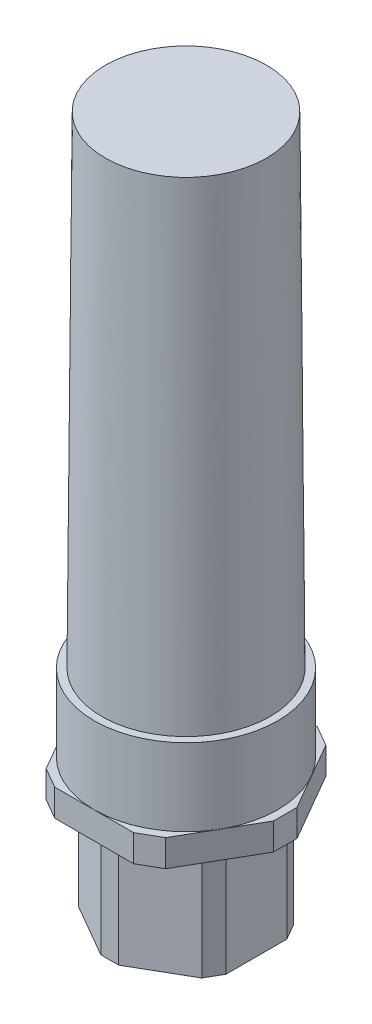
ISO-10303-21;
HEADER;
FILE_DESCRIPTION(('STEP AP214'),'2;1');
FILE_NAME('part.step','',(''),(''),'','','');
FILE_SCHEMA(('AUTOMOTIVE_DESIGN { 1 0 10303 214 1 1 1 1 }'));
ENDSEC;
DATA;
#1=APPLICATION_CONTEXT('core data for automotive mechanical design processes');
#2=APPLICATION_PROTOCOL_DEFINITION('international standard','automotive_design',2000,#1);
#3=PRODUCT_CONTEXT('',#1,'mechanical');
#4=PRODUCT('Part','Part','',(#3));
#5=PRODUCT_RELATED_PRODUCT_CATEGORY('part','',(#4));
#6=PRODUCT_DEFINITION_FORMATION('','',#4);
#7=PRODUCT_DEFINITION_CONTEXT('part definition',#1,'design');
#8=PRODUCT_DEFINITION('design','',#6,#7);
#9=PRODUCT_DEFINITION_SHAPE('','',#8);
#10=(LENGTH_UNIT() NAMED_UNIT(*) SI_UNIT(.MILLI.,.METRE.));
#11=(NAMED_UNIT(*) PLANE_ANGLE_UNIT() SI_UNIT($,.RADIAN.));
#12=(NAMED_UNIT(*) SI_UNIT($,.STERADIAN.) SOLID_ANGLE_UNIT());
#13=UNCERTAINTY_MEASURE_WITH_UNIT(LENGTH_MEASURE(1.E-05),#10,'distance_accuracy_value','');
#14=(GEOMETRIC_REPRESENTATION_CONTEXT(3) GLOBAL_UNCERTAINTY_ASSIGNED_CONTEXT((#13)) GLOBAL_UNIT_ASSIGNED_CONTEXT((#10,
#11,#12)) REPRESENTATION_CONTEXT('',''));
#15=CARTESIAN_POINT('',(0.,0.,0.));
#16=DIRECTION('',(0.,0.,1.));
#17=DIRECTION('',(1.,0.,0.));
#18=AXIS2_PLACEMENT_3D('',#15,#16,#17);
#19=CARTESIAN_POINT('',(0.,49.2252,0.));
#20=DIRECTION('',(0.,1.,0.));
#21=DIRECTION('',(0.,0.,1.));
#22=AXIS2_PLACEMENT_3D('',#19,#20,#21);
#23=PLANE('',#22);
#24=CARTESIAN_POINT('',(0.,49.2252,0.));
#25=DIRECTION('',(0.,1.,0.));
#26=DIRECTION('',(0.,0.,1.));
#27=AXIS2_PLACEMENT_3D('',#24,#25,#26);
#28=CIRCLE('',#27,21.0058);
#29=CARTESIAN_POINT('',(0.,49.2252,21.0058));
#30=VERTEX_POINT('',#29);
#31=EDGE_CURVE('E205',#30,#30,#28,.T.);
#32=ORIENTED_EDGE('',*,*,#31,.T.);
#33=EDGE_LOOP('',(#32));
#34=FACE_BOUND('',#33,.T.);
#35=CARTESIAN_POINT('',(0.,49.2252,0.));
#36=DIRECTION('',(0.,1.,0.));
#37=DIRECTION('',(0.,0.,1.));
#38=AXIS2_PLACEMENT_3D('',#35,#36,#37);
#39=CIRCLE('',#38,19.2913);
#40=CARTESIAN_POINT('',(19.2913,49.2252,0.));
#41=VERTEX_POINT('',#40);
#42=EDGE_CURVE('E202',#41,#41,#39,.T.);
#43=ORIENTED_EDGE('',*,*,#42,.F.);
#44=EDGE_LOOP('',(#43));
#45=FACE_BOUND('',#44,.T.);
#46=ADVANCED_FACE('F57',(#34,#45),#23,.T.);
#47=CARTESIAN_POINT('',(0.,0.,0.));
#48=DIRECTION('',(0.,1.,0.));
#49=DIRECTION('',(0.,0.,1.));
#50=AXIS2_PLACEMENT_3D('',#47,#48,#49);
#51=PLANE('',#50);
#52=DIRECTION('',(0.,0.,1.));
#53=VECTOR('',#52,1.);
#54=CARTESIAN_POINT('',(16.1417,0.,0.));
#55=LINE('',#54,#53);
#56=CARTESIAN_POINT('',(16.1417,0.,-6.96675547946546));
#57=VERTEX_POINT('',#56);
#58=CARTESIAN_POINT('',(16.1417,0.,6.96675547946546));
#59=VERTEX_POINT('',#58);
#60=EDGE_CURVE('E146',#57,#59,#55,.T.);
#61=ORIENTED_EDGE('',*,*,#60,.T.);
#62=DIRECTION('',(-0.5,0.,0.866025403784439));
#63=VECTOR('',#62,1.);
#64=CARTESIAN_POINT('',(15.1229686135858,0.,8.73125));
#65=LINE('',#64,#63);
#66=CARTESIAN_POINT('',(14.1042372271715,0.,10.4957445205345));
#67=VERTEX_POINT('',#66);
#68=EDGE_CURVE('E148',#59,#67,#65,.T.);
#69=ORIENTED_EDGE('',*,*,#68,.T.);
#70=DIRECTION('',(-0.866025403784439,0.,0.5));
#71=VECTOR('',#70,1.);
#72=CARTESIAN_POINT('',(8.07085,0.,13.9791222602673));
#73=LINE('',#72,#71);
#74=CARTESIAN_POINT('',(2.03746277282847,0.,17.4625));
#75=VERTEX_POINT('',#74);
#76=EDGE_CURVE('E326',#67,#75,#73,.T.);
#77=ORIENTED_EDGE('',*,*,#76,.T.);
#78=DIRECTION('',(-1.,0.,0.));
#79=VECTOR('',#78,1.);
#80=CARTESIAN_POINT('',(0.,0.,17.4625));
#81=LINE('',#80,#79);
#82=CARTESIAN_POINT('',(-2.03746277282847,0.,17.4625));
#83=VERTEX_POINT('',#82);
#84=EDGE_CURVE('E329',#75,#83,#81,.T.);
#85=ORIENTED_EDGE('',*,*,#84,.T.);
#86=DIRECTION('',(-0.866025403784439,0.,-0.5));
#87=VECTOR('',#86,1.);
#88=CARTESIAN_POINT('',(-8.07084999999999,0.,13.9791222602673));
#89=LINE('',#88,#87);
#90=CARTESIAN_POINT('',(-14.1042372271715,0.,10.4957445205345));
#91=VERTEX_POINT('',#90);
#92=EDGE_CURVE('E332',#83,#91,#89,.T.);
#93=ORIENTED_EDGE('',*,*,#92,.T.);
#94=DIRECTION('',(-0.5,0.,-0.866025403784439));
#95=VECTOR('',#94,1.);
#96=CARTESIAN_POINT('',(-15.1229686135858,0.,8.73125));
#97=LINE('',#96,#95);
#98=CARTESIAN_POINT('',(-16.1417,0.,6.96675547946546));
#99=VERTEX_POINT('',#98);
#100=EDGE_CURVE('E335',#91,#99,#97,.T.);
#101=ORIENTED_EDGE('',*,*,#100,.T.);
#102=DIRECTION('',(0.,0.,-1.));
#103=VECTOR('',#102,1.);
#104=CARTESIAN_POINT('',(-16.1417,0.,0.));
#105=LINE('',#104,#103);
#106=CARTESIAN_POINT('',(-16.1417,0.,-6.96675547946546));
#107=VERTEX_POINT('',#106);
#108=EDGE_CURVE('E338',#99,#107,#105,.T.);
#109=ORIENTED_EDGE('',*,*,#108,.T.);
#110=DIRECTION('',(0.499999999999999,0.,-0.866025403784439));
#111=VECTOR('',#110,1.);
#112=CARTESIAN_POINT('',(-15.1229686135858,0.,-8.73124999999999));
#113=LINE('',#112,#111);
#114=CARTESIAN_POINT('',(-14.1042372271715,0.,-10.4957445205345));
#115=VERTEX_POINT('',#114);
#116=EDGE_CURVE('E341',#107,#115,#113,.T.);
#117=ORIENTED_EDGE('',*,*,#116,.T.);
#118=DIRECTION('',(0.866025403784438,0.,-0.5));
#119=VECTOR('',#118,1.);
#120=CARTESIAN_POINT('',(-8.07085,0.,-13.9791222602673));
#121=LINE('',#120,#119);
#122=CARTESIAN_POINT('',(-2.03746277282848,0.,-17.4625));
#123=VERTEX_POINT('',#122);
#124=EDGE_CURVE('E142',#115,#123,#121,.T.);
#125=ORIENTED_EDGE('',*,*,#124,.T.);
#126=DIRECTION('',(1.,0.,0.));
#127=VECTOR('',#126,1.);
#128=CARTESIAN_POINT('',(0.,0.,-17.4625));
#129=LINE('',#128,#127);
#130=CARTESIAN_POINT('',(2.03746277282846,0.,-17.4625));
#131=VERTEX_POINT('',#130);
#132=EDGE_CURVE('E140',#123,#131,#129,.T.);
#133=ORIENTED_EDGE('',*,*,#132,.T.);
#134=DIRECTION('',(0.866025403784439,0.,0.5));
#135=VECTOR('',#134,1.);
#136=CARTESIAN_POINT('',(8.07084999999999,0.,-13.9791222602673));
#137=LINE('',#136,#135);
#138=CARTESIAN_POINT('',(14.1042372271715,0.,-10.4957445205345));
#139=VERTEX_POINT('',#138);
#140=EDGE_CURVE('E120',#131,#139,#137,.T.);
#141=ORIENTED_EDGE('',*,*,#140,.T.);
#142=DIRECTION('',(0.499999999999999,0.,0.866025403784439));
#143=VECTOR('',#142,1.);
#144=CARTESIAN_POINT('',(15.1229686135858,0.,-8.73124999999999));
#145=LINE('',#144,#143);
#146=EDGE_CURVE('E130',#139,#57,#145,.T.);
#147=ORIENTED_EDGE('',*,*,#146,.T.);
#148=EDGE_LOOP('',(#61,#69,#77,#85,#93,#101,#109,#117,#125,#133,#141,#147));
#149=FACE_BOUND('',#148,.T.);
#150=ADVANCED_FACE('F137',(#149),#51,.F.);
#151=CARTESIAN_POINT('',(15.1229686135858,72.9602096353664,8.73125));
#152=DIRECTION('',(0.866025403784438,0.,0.5));
#153=DIRECTION('',(0.5,0.,-0.866025403784439));
#154=AXIS2_PLACEMENT_3D('',#151,#152,#153);
#155=PLANE('',#154);
#156=DIRECTION('',(0.,-1.,0.));
#157=VECTOR('',#156,1.);
#158=CARTESIAN_POINT('',(16.1417,72.9602096353664,6.96675547946546));
#159=LINE('',#158,#157);
#160=CARTESIAN_POINT('',(16.1417,25.4,6.96675547946546));
#161=VERTEX_POINT('',#160);
#162=EDGE_CURVE('E69',#161,#59,#159,.T.);
#163=ORIENTED_EDGE('',*,*,#162,.F.);
#164=DIRECTION('',(-0.5,0.,0.866025403784439));
#165=VECTOR('',#164,1.);
#166=CARTESIAN_POINT('',(15.1229686135858,25.4,8.73125));
#167=LINE('',#166,#165);
#168=CARTESIAN_POINT('',(14.1042372271715,25.4,10.4957445205345));
#169=VERTEX_POINT('',#168);
#170=EDGE_CURVE('E135',#161,#169,#167,.T.);
#171=ORIENTED_EDGE('',*,*,#170,.T.);
#172=DIRECTION('',(0.,-1.,0.));
#173=VECTOR('',#172,1.);
#174=CARTESIAN_POINT('',(14.1042372271715,72.9602096353664,10.4957445205345));
#175=LINE('',#174,#173);
#176=EDGE_CURVE('E152',#169,#67,#175,.T.);
#177=ORIENTED_EDGE('',*,*,#176,.T.);
#178=ORIENTED_EDGE('',*,*,#68,.F.);
#179=EDGE_LOOP('',(#163,#171,#177,#178));
#180=FACE_BOUND('',#179,.T.);
#181=ADVANCED_FACE('F59',(#180),#155,.T.);
#182=CARTESIAN_POINT('',(8.07085,72.9602096353664,13.9791222602673));
#183=DIRECTION('',(0.5,0.,0.866025403784438));
#184=DIRECTION('',(0.866025403784439,0.,-0.5));
#185=AXIS2_PLACEMENT_3D('',#182,#183,#184);
#186=PLANE('',#185);
#187=ORIENTED_EDGE('',*,*,#176,.F.);
#188=DIRECTION('',(-0.866025403784439,0.,0.5));
#189=VECTOR('',#188,1.);
#190=CARTESIAN_POINT('',(8.07085,25.4,13.9791222602673));
#191=LINE('',#190,#189);
#192=CARTESIAN_POINT('',(2.03746277282847,25.4,17.4625));
#193=VERTEX_POINT('',#192);
#194=EDGE_CURVE('E186',#169,#193,#191,.T.);
#195=ORIENTED_EDGE('',*,*,#194,.T.);
#196=DIRECTION('',(0.,-1.,0.));
#197=VECTOR('',#196,1.);
#198=CARTESIAN_POINT('',(2.03746277282847,72.9602096353664,17.4625));
#199=LINE('',#198,#197);
#200=EDGE_CURVE('E185',#193,#75,#199,.T.);
#201=ORIENTED_EDGE('',*,*,#200,.T.);
#202=ORIENTED_EDGE('',*,*,#76,.F.);
#203=EDGE_LOOP('',(#187,#195,#201,#202));
#204=FACE_BOUND('',#203,.T.);
#205=ADVANCED_FACE('F375',(#204),#186,.T.);
#206=CARTESIAN_POINT('',(0.,72.9602096353664,17.4625));
#207=DIRECTION('',(0.,0.,1.));
#208=DIRECTION('',(1.,0.,0.));
#209=AXIS2_PLACEMENT_3D('',#206,#207,#208);
#210=PLANE('',#209);
#211=ORIENTED_EDGE('',*,*,#200,.F.);
#212=DIRECTION('',(-1.,0.,0.));
#213=VECTOR('',#212,1.);
#214=CARTESIAN_POINT('',(0.,25.4,17.4625));
#215=LINE('',#214,#213);
#216=CARTESIAN_POINT('',(-2.03746277282847,25.4,17.4625));
#217=VERTEX_POINT('',#216);
#218=EDGE_CURVE('E182',#193,#217,#215,.T.);
#219=ORIENTED_EDGE('',*,*,#218,.T.);
#220=DIRECTION('',(0.,-1.,0.));
#221=VECTOR('',#220,1.);
#222=CARTESIAN_POINT('',(-2.03746277282847,72.9602096353664,17.4625));
#223=LINE('',#222,#221);
#224=EDGE_CURVE('E181',#217,#83,#223,.T.);
#225=ORIENTED_EDGE('',*,*,#224,.T.);
#226=ORIENTED_EDGE('',*,*,#84,.F.);
#227=EDGE_LOOP('',(#211,#219,#225,#226));
#228=FACE_BOUND('',#227,.T.);
#229=ADVANCED_FACE('F413',(#228),#210,.T.);
#230=CARTESIAN_POINT('',(-8.07084999999999,72.9602096353664,13.9791222602673));
#231=DIRECTION('',(-0.5,0.,0.866025403784439));
#232=DIRECTION('',(0.866025403784439,0.,0.5));
#233=AXIS2_PLACEMENT_3D('',#230,#231,#232);
#234=PLANE('',#233);
#235=ORIENTED_EDGE('',*,*,#224,.F.);
#236=DIRECTION('',(-0.866025403784439,0.,-0.5));
#237=VECTOR('',#236,1.);
#238=CARTESIAN_POINT('',(-8.07084999999999,25.4,13.9791222602673));
#239=LINE('',#238,#237);
#240=CARTESIAN_POINT('',(-14.1042372271715,25.4,10.4957445205345));
#241=VERTEX_POINT('',#240);
#242=EDGE_CURVE('E178',#217,#241,#239,.T.);
#243=ORIENTED_EDGE('',*,*,#242,.T.);
#244=DIRECTION('',(0.,-1.,0.));
#245=VECTOR('',#244,1.);
#246=CARTESIAN_POINT('',(-14.1042372271715,72.9602096353664,10.4957445205345));
#247=LINE('',#246,#245);
#248=EDGE_CURVE('E177',#241,#91,#247,.T.);
#249=ORIENTED_EDGE('',*,*,#248,.T.);
#250=ORIENTED_EDGE('',*,*,#92,.F.);
#251=EDGE_LOOP('',(#235,#243,#249,#250));
#252=FACE_BOUND('',#251,.T.);
#253=ADVANCED_FACE('F410',(#252),#234,.T.);
#254=CARTESIAN_POINT('',(-15.1229686135858,72.9602096353664,8.73125));
#255=DIRECTION('',(-0.866025403784439,0.,0.5));
#256=DIRECTION('',(0.5,0.,0.866025403784439));
#257=AXIS2_PLACEMENT_3D('',#254,#255,#256);
#258=PLANE('',#257);
#259=ORIENTED_EDGE('',*,*,#248,.F.);
#260=DIRECTION('',(-0.5,0.,-0.866025403784439));
#261=VECTOR('',#260,1.);
#262=CARTESIAN_POINT('',(-15.1229686135858,25.4,8.73125));
#263=LINE('',#262,#261);
#264=CARTESIAN_POINT('',(-16.1417,25.4,6.96675547946546));
#265=VERTEX_POINT('',#264);
#266=EDGE_CURVE('E174',#241,#265,#263,.T.);
#267=ORIENTED_EDGE('',*,*,#266,.T.);
#268=DIRECTION('',(0.,-1.,0.));
#269=VECTOR('',#268,1.);
#270=CARTESIAN_POINT('',(-16.1417,72.9602096353664,6.96675547946546));
#271=LINE('',#270,#269);
#272=EDGE_CURVE('E173',#265,#99,#271,.T.);
#273=ORIENTED_EDGE('',*,*,#272,.T.);
#274=ORIENTED_EDGE('',*,*,#100,.F.);
#275=EDGE_LOOP('',(#259,#267,#273,#274));
#276=FACE_BOUND('',#275,.T.);
#277=ADVANCED_FACE('F406',(#276),#258,.T.);
#278=CARTESIAN_POINT('',(-16.1417,72.9602096353664,0.));
#279=DIRECTION('',(-1.,0.,0.));
#280=DIRECTION('',(0.,0.,1.));
#281=AXIS2_PLACEMENT_3D('',#278,#279,#280);
#282=PLANE('',#281);
#283=ORIENTED_EDGE('',*,*,#272,.F.);
#284=DIRECTION('',(0.,0.,-1.));
#285=VECTOR('',#284,1.);
#286=CARTESIAN_POINT('',(-16.1417,25.4,0.));
#287=LINE('',#286,#285);
#288=CARTESIAN_POINT('',(-16.1417,25.4,-6.96675547946546));
#289=VERTEX_POINT('',#288);
#290=EDGE_CURVE('E170',#265,#289,#287,.T.);
#291=ORIENTED_EDGE('',*,*,#290,.T.);
#292=DIRECTION('',(0.,-1.,0.));
#293=VECTOR('',#292,1.);
#294=CARTESIAN_POINT('',(-16.1417,72.9602096353664,-6.96675547946546));
#295=LINE('',#294,#293);
#296=EDGE_CURVE('E169',#289,#107,#295,.T.);
#297=ORIENTED_EDGE('',*,*,#296,.T.);
#298=ORIENTED_EDGE('',*,*,#108,.F.);
#299=EDGE_LOOP('',(#283,#291,#297,#298));
#300=FACE_BOUND('',#299,.T.);
#301=ADVANCED_FACE('F402',(#300),#282,.T.);
#302=CARTESIAN_POINT('',(-15.1229686135858,72.9602096353664,-8.73124999999999));
#303=DIRECTION('',(-0.866025403784439,0.,-0.499999999999999));
#304=DIRECTION('',(-0.499999999999999,0.,0.866025403784439));
#305=AXIS2_PLACEMENT_3D('',#302,#303,#304);
#306=PLANE('',#305);
#307=ORIENTED_EDGE('',*,*,#296,.F.);
#308=DIRECTION('',(0.499999999999999,0.,-0.866025403784439));
#309=VECTOR('',#308,1.);
#310=CARTESIAN_POINT('',(-15.1229686135858,25.4,-8.73124999999999));
#311=LINE('',#310,#309);
#312=CARTESIAN_POINT('',(-14.1042372271715,25.4,-10.4957445205345));
#313=VERTEX_POINT('',#312);
#314=EDGE_CURVE('E166',#289,#313,#311,.T.);
#315=ORIENTED_EDGE('',*,*,#314,.T.);
#316=DIRECTION('',(0.,-1.,0.));
#317=VECTOR('',#316,1.);
#318=CARTESIAN_POINT('',(-14.1042372271715,72.9602096353664,-10.4957445205345));
#319=LINE('',#318,#317);
#320=EDGE_CURVE('E165',#313,#115,#319,.T.);
#321=ORIENTED_EDGE('',*,*,#320,.T.);
#322=ORIENTED_EDGE('',*,*,#116,.F.);
#323=EDGE_LOOP('',(#307,#315,#321,#322));
#324=FACE_BOUND('',#323,.T.);
#325=ADVANCED_FACE('F399',(#324),#306,.T.);
#326=CARTESIAN_POINT('',(-8.07085,72.9602096353664,-13.9791222602673));
#327=DIRECTION('',(-0.5,0.,-0.866025403784438));
#328=DIRECTION('',(-0.866025403784438,0.,0.5));
#329=AXIS2_PLACEMENT_3D('',#326,#327,#328);
#330=PLANE('',#329);
#331=ORIENTED_EDGE('',*,*,#320,.F.);
#332=DIRECTION('',(0.866025403784438,0.,-0.5));
#333=VECTOR('',#332,1.);
#334=CARTESIAN_POINT('',(-8.07085,25.4,-13.9791222602673));
#335=LINE('',#334,#333);
#336=CARTESIAN_POINT('',(-2.03746277282848,25.4,-17.4625));
#337=VERTEX_POINT('',#336);
#338=EDGE_CURVE('E162',#313,#337,#335,.T.);
#339=ORIENTED_EDGE('',*,*,#338,.T.);
#340=DIRECTION('',(0.,-1.,0.));
#341=VECTOR('',#340,1.);
#342=CARTESIAN_POINT('',(-2.03746277282848,72.9602096353664,-17.4625));
#343=LINE('',#342,#341);
#344=EDGE_CURVE('E161',#337,#123,#343,.T.);
#345=ORIENTED_EDGE('',*,*,#344,.T.);
#346=ORIENTED_EDGE('',*,*,#124,.F.);
#347=EDGE_LOOP('',(#331,#339,#345,#346));
#348=FACE_BOUND('',#347,.T.);
#349=ADVANCED_FACE('F347',(#348),#330,.T.);
#350=CARTESIAN_POINT('',(0.,72.9602096353664,-17.4625));
#351=DIRECTION('',(0.,0.,-1.));
#352=DIRECTION('',(-1.,0.,0.));
#353=AXIS2_PLACEMENT_3D('',#350,#351,#352);
#354=PLANE('',#353);
#355=ORIENTED_EDGE('',*,*,#344,.F.);
#356=DIRECTION('',(1.,0.,0.));
#357=VECTOR('',#356,1.);
#358=CARTESIAN_POINT('',(0.,25.4,-17.4625));
#359=LINE('',#358,#357);
#360=CARTESIAN_POINT('',(2.03746277282846,25.4,-17.4625));
#361=VERTEX_POINT('',#360);
#362=EDGE_CURVE('E158',#337,#361,#359,.T.);
#363=ORIENTED_EDGE('',*,*,#362,.T.);
#364=DIRECTION('',(0.,-1.,0.));
#365=VECTOR('',#364,1.);
#366=CARTESIAN_POINT('',(2.03746277282846,72.9602096353664,-17.4625));
#367=LINE('',#366,#365);
#368=EDGE_CURVE('E157',#361,#131,#367,.T.);
#369=ORIENTED_EDGE('',*,*,#368,.T.);
#370=ORIENTED_EDGE('',*,*,#132,.F.);
#371=EDGE_LOOP('',(#355,#363,#369,#370));
#372=FACE_BOUND('',#371,.T.);
#373=ADVANCED_FACE('F353',(#372),#354,.T.);
#374=CARTESIAN_POINT('',(8.07084999999999,72.9602096353664,-13.9791222602673));
#375=DIRECTION('',(0.499999999999999,0.,-0.866025403784439));
#376=DIRECTION('',(-0.866025403784439,0.,-0.499999999999999));
#377=AXIS2_PLACEMENT_3D('',#374,#375,#376);
#378=PLANE('',#377);
#379=ORIENTED_EDGE('',*,*,#368,.F.);
#380=DIRECTION('',(0.866025403784439,0.,0.499999999999999));
#381=VECTOR('',#380,1.);
#382=CARTESIAN_POINT('',(8.07084999999999,25.4,-13.9791222602673));
#383=LINE('',#382,#381);
#384=CARTESIAN_POINT('',(14.1042372271715,25.4,-10.4957445205345));
#385=VERTEX_POINT('',#384);
#386=EDGE_CURVE('E124',#361,#385,#383,.T.);
#387=ORIENTED_EDGE('',*,*,#386,.T.);
#388=DIRECTION('',(0.,-1.,0.));
#389=VECTOR('',#388,1.);
#390=CARTESIAN_POINT('',(14.1042372271715,72.9602096353664,-10.4957445205345));
#391=LINE('',#390,#389);
#392=EDGE_CURVE('E115',#385,#139,#391,.T.);
#393=ORIENTED_EDGE('',*,*,#392,.T.);
#394=ORIENTED_EDGE('',*,*,#140,.F.);
#395=EDGE_LOOP('',(#379,#387,#393,#394));
#396=FACE_BOUND('',#395,.T.);
#397=ADVANCED_FACE('F118',(#396),#378,.T.);
#398=CARTESIAN_POINT('',(15.1229686135858,72.9602096353664,-8.73124999999999));
#399=DIRECTION('',(0.866025403784439,0.,-0.499999999999999));
#400=DIRECTION('',(-0.499999999999999,0.,-0.866025403784439));
#401=AXIS2_PLACEMENT_3D('',#398,#399,#400);
#402=PLANE('',#401);
#403=ORIENTED_EDGE('',*,*,#392,.F.);
#404=DIRECTION('',(0.499999999999999,0.,0.866025403784439));
#405=VECTOR('',#404,1.);
#406=CARTESIAN_POINT('',(15.1229686135858,25.4,-8.73124999999999));
#407=LINE('',#406,#405);
#408=CARTESIAN_POINT('',(16.1417,25.4,-6.96675547946546));
#409=VERTEX_POINT('',#408);
#410=EDGE_CURVE('E127',#385,#409,#407,.T.);
#411=ORIENTED_EDGE('',*,*,#410,.T.);
#412=DIRECTION('',(0.,-1.,0.));
#413=VECTOR('',#412,1.);
#414=CARTESIAN_POINT('',(16.1417,72.9602096353664,-6.96675547946546));
#415=LINE('',#414,#413);
#416=EDGE_CURVE('E133',#409,#57,#415,.T.);
#417=ORIENTED_EDGE('',*,*,#416,.T.);
#418=ORIENTED_EDGE('',*,*,#146,.F.);
#419=EDGE_LOOP('',(#403,#411,#417,#418));
#420=FACE_BOUND('',#419,.T.);
#421=ADVANCED_FACE('F131',(#420),#402,.T.);
#422=CARTESIAN_POINT('',(16.1417,72.9602096353664,0.));
#423=DIRECTION('',(1.,0.,0.));
#424=DIRECTION('',(0.,0.,-1.));
#425=AXIS2_PLACEMENT_3D('',#422,#423,#424);
#426=PLANE('',#425);
#427=ORIENTED_EDGE('',*,*,#416,.F.);
#428=DIRECTION('',(0.,0.,1.));
#429=VECTOR('',#428,1.);
#430=CARTESIAN_POINT('',(16.1417,25.4,0.));
#431=LINE('',#430,#429);
#432=EDGE_CURVE('E153',#409,#161,#431,.T.);
#433=ORIENTED_EDGE('',*,*,#432,.T.);
#434=ORIENTED_EDGE('',*,*,#162,.T.);
#435=ORIENTED_EDGE('',*,*,#60,.F.);
#436=EDGE_LOOP('',(#427,#433,#434,#435));
#437=FACE_BOUND('',#436,.T.);
#438=ADVANCED_FACE('F414',(#437),#426,.T.);
#439=CARTESIAN_POINT('',(0.,25.4,0.));
#440=DIRECTION('',(0.,-1.,0.));
#441=DIRECTION('',(0.,0.,-1.));
#442=AXIS2_PLACEMENT_3D('',#439,#440,#441);
#443=PLANE('',#442);
#444=DIRECTION('',(-0.5,0.,-0.866025403784439));
#445=VECTOR('',#444,1.);
#446=CARTESIAN_POINT('',(22.733,25.4,-2.68768899153671));
#447=LINE('',#446,#445);
#448=CARTESIAN_POINT('',(22.733,25.4,-2.68768899153671));
#449=VERTEX_POINT('',#448);
#450=CARTESIAN_POINT('',(13.6941069441426,25.4,-18.3435110084633));
#451=VERTEX_POINT('',#450);
#452=EDGE_CURVE('E263',#449,#451,#447,.T.);
#453=ORIENTED_EDGE('',*,*,#452,.F.);
#454=DIRECTION('',(0.,0.,-1.));
#455=VECTOR('',#454,1.);
#456=CARTESIAN_POINT('',(22.733,25.4,-2.68768899153671));
#457=LINE('',#456,#455);
#458=CARTESIAN_POINT('',(22.733,25.4,2.68768899153671));
#459=VERTEX_POINT('',#458);
#460=EDGE_CURVE('E218',#459,#449,#457,.T.);
#461=ORIENTED_EDGE('',*,*,#460,.F.);
#462=DIRECTION('',(0.5,0.,-0.866025403784439));
#463=VECTOR('',#462,1.);
#464=CARTESIAN_POINT('',(13.6941069441426,25.4,18.3435110084633));
#465=LINE('',#464,#463);
#466=CARTESIAN_POINT('',(13.6941069441426,25.4,18.3435110084633));
#467=VERTEX_POINT('',#466);
#468=EDGE_CURVE('E223',#467,#459,#465,.T.);
#469=ORIENTED_EDGE('',*,*,#468,.F.);
#470=DIRECTION('',(0.866025403784438,0.,-0.500000000000001));
#471=VECTOR('',#470,1.);
#472=CARTESIAN_POINT('',(13.6941069441426,25.4,18.3435110084633));
#473=LINE('',#472,#471);
#474=CARTESIAN_POINT('',(9.03889305585743,25.4,21.0312));
#475=VERTEX_POINT('',#474);
#476=EDGE_CURVE('E227',#475,#467,#473,.T.);
#477=ORIENTED_EDGE('',*,*,#476,.F.);
#478=DIRECTION('',(1.,0.,0.));
#479=VECTOR('',#478,1.);
#480=CARTESIAN_POINT('',(-9.03889305585743,25.4,21.0312));
#481=LINE('',#480,#479);
#482=CARTESIAN_POINT('',(-9.03889305585743,25.4,21.0312));
#483=VERTEX_POINT('',#482);
#484=EDGE_CURVE('E231',#483,#475,#481,.T.);
#485=ORIENTED_EDGE('',*,*,#484,.F.);
#486=DIRECTION('',(0.866025403784439,0.,0.5));
#487=VECTOR('',#486,1.);
#488=CARTESIAN_POINT('',(-9.03889305585743,25.4,21.0312));
#489=LINE('',#488,#487);
#490=CARTESIAN_POINT('',(-13.6941069441426,25.4,18.3435110084633));
#491=VERTEX_POINT('',#490);
#492=EDGE_CURVE('E235',#491,#483,#489,.T.);
#493=ORIENTED_EDGE('',*,*,#492,.F.);
#494=DIRECTION('',(0.5,0.,0.866025403784439));
#495=VECTOR('',#494,1.);
#496=CARTESIAN_POINT('',(-22.733,25.4,2.68768899153672));
#497=LINE('',#496,#495);
#498=CARTESIAN_POINT('',(-22.733,25.4,2.68768899153672));
#499=VERTEX_POINT('',#498);
#500=EDGE_CURVE('E239',#499,#491,#497,.T.);
#501=ORIENTED_EDGE('',*,*,#500,.F.);
#502=DIRECTION('',(0.,0.,1.));
#503=VECTOR('',#502,1.);
#504=CARTESIAN_POINT('',(-22.733,25.4,2.68768899153672));
#505=LINE('',#504,#503);
#506=CARTESIAN_POINT('',(-22.733,25.4,-2.68768899153671));
#507=VERTEX_POINT('',#506);
#508=EDGE_CURVE('E243',#507,#499,#505,.T.);
#509=ORIENTED_EDGE('',*,*,#508,.F.);
#510=DIRECTION('',(-0.5,0.,0.866025403784439));
#511=VECTOR('',#510,1.);
#512=CARTESIAN_POINT('',(-13.6941069441426,25.4,-18.3435110084633));
#513=LINE('',#512,#511);
#514=CARTESIAN_POINT('',(-13.6941069441426,25.4,-18.3435110084633));
#515=VERTEX_POINT('',#514);
#516=EDGE_CURVE('E247',#515,#507,#513,.T.);
#517=ORIENTED_EDGE('',*,*,#516,.F.);
#518=DIRECTION('',(-0.866025403784438,0.,0.500000000000001));
#519=VECTOR('',#518,1.);
#520=CARTESIAN_POINT('',(-13.6941069441426,25.4,-18.3435110084633));
#521=LINE('',#520,#519);
#522=CARTESIAN_POINT('',(-9.03889305585744,25.4,-21.0312));
#523=VERTEX_POINT('',#522);
#524=EDGE_CURVE('E251',#523,#515,#521,.T.);
#525=ORIENTED_EDGE('',*,*,#524,.F.);
#526=DIRECTION('',(-1.,0.,0.));
#527=VECTOR('',#526,1.);
#528=CARTESIAN_POINT('',(9.03889305585741,25.4,-21.0312));
#529=LINE('',#528,#527);
#530=CARTESIAN_POINT('',(9.03889305585741,25.4,-21.0312));
#531=VERTEX_POINT('',#530);
#532=EDGE_CURVE('E255',#531,#523,#529,.T.);
#533=ORIENTED_EDGE('',*,*,#532,.F.);
#534=DIRECTION('',(-0.866025403784439,0.,-0.5));
#535=VECTOR('',#534,1.);
#536=CARTESIAN_POINT('',(9.03889305585741,25.4,-21.0312));
#537=LINE('',#536,#535);
#538=EDGE_CURVE('E259',#451,#531,#537,.T.);
#539=ORIENTED_EDGE('',*,*,#538,.F.);
#540=EDGE_LOOP('',(#453,#461,#469,#477,#485,#493,#501,#509,#517,#525,#533,#539));
#541=FACE_BOUND('',#540,.T.);
#542=ORIENTED_EDGE('',*,*,#432,.F.);
#543=ORIENTED_EDGE('',*,*,#410,.F.);
#544=ORIENTED_EDGE('',*,*,#386,.F.);
#545=ORIENTED_EDGE('',*,*,#362,.F.);
#546=ORIENTED_EDGE('',*,*,#338,.F.);
#547=ORIENTED_EDGE('',*,*,#314,.F.);
#548=ORIENTED_EDGE('',*,*,#290,.F.);
#549=ORIENTED_EDGE('',*,*,#266,.F.);
#550=ORIENTED_EDGE('',*,*,#242,.F.);
#551=ORIENTED_EDGE('',*,*,#218,.F.);
#552=ORIENTED_EDGE('',*,*,#194,.F.);
#553=ORIENTED_EDGE('',*,*,#170,.F.);
#554=EDGE_LOOP('',(#542,#543,#544,#545,#546,#547,#548,#549,#550,#551,#552,#553));
#555=FACE_BOUND('',#554,.T.);
#556=ADVANCED_FACE('F368',(#541,#555),#443,.T.);
#557=CARTESIAN_POINT('',(22.733,93.5109007432348,-2.68768899153671));
#558=DIRECTION('',(-0.866025403784439,0.,0.5));
#559=DIRECTION('',(0.5,0.,0.866025403784439));
#560=AXIS2_PLACEMENT_3D('',#557,#558,#559);
#561=PLANE('',#560);
#562=DIRECTION('',(-0.5,0.,-0.866025403784439));
#563=VECTOR('',#562,1.);
#564=CARTESIAN_POINT('',(22.733,31.5722,-2.68768899153671));
#565=LINE('',#564,#563);
#566=CARTESIAN_POINT('',(22.733,31.5722,-2.68768899153671));
#567=VERTEX_POINT('',#566);
#568=CARTESIAN_POINT('',(13.6941069441426,31.5722,-18.3435110084633));
#569=VERTEX_POINT('',#568);
#570=EDGE_CURVE('E295',#567,#569,#565,.T.);
#571=ORIENTED_EDGE('',*,*,#570,.F.);
#572=DIRECTION('',(0.,-1.,0.));
#573=VECTOR('',#572,1.);
#574=CARTESIAN_POINT('',(22.733,93.5109007432348,-2.68768899153671));
#575=LINE('',#574,#573);
#576=EDGE_CURVE('E209',#567,#449,#575,.T.);
#577=ORIENTED_EDGE('',*,*,#576,.T.);
#578=ORIENTED_EDGE('',*,*,#452,.T.);
#579=DIRECTION('',(0.,-1.,0.));
#580=VECTOR('',#579,1.);
#581=CARTESIAN_POINT('',(13.6941069441426,93.5109007432348,-18.3435110084633));
#582=LINE('',#581,#580);
#583=EDGE_CURVE('E262',#569,#451,#582,.T.);
#584=ORIENTED_EDGE('',*,*,#583,.F.);
#585=EDGE_LOOP('',(#571,#577,#578,#584));
#586=FACE_BOUND('',#585,.T.);
#587=ADVANCED_FACE('F421',(#586),#561,.F.);
#588=CARTESIAN_POINT('',(9.03889305585741,93.5109007432348,-21.0312));
#589=DIRECTION('',(-0.5,0.,0.866025403784439));
#590=DIRECTION('',(0.866025403784439,0.,0.5));
#591=AXIS2_PLACEMENT_3D('',#588,#589,#590);
#592=PLANE('',#591);
#593=DIRECTION('',(-0.866025403784439,0.,-0.5));
#594=VECTOR('',#593,1.);
#595=CARTESIAN_POINT('',(9.03889305585741,31.5722,-21.0312));
#596=LINE('',#595,#594);
#597=CARTESIAN_POINT('',(9.03889305585741,31.5722,-21.0312));
#598=VERTEX_POINT('',#597);
#599=EDGE_CURVE('E292',#569,#598,#596,.T.);
#600=ORIENTED_EDGE('',*,*,#599,.F.);
#601=ORIENTED_EDGE('',*,*,#583,.T.);
#602=ORIENTED_EDGE('',*,*,#538,.T.);
#603=DIRECTION('',(0.,-1.,0.));
#604=VECTOR('',#603,1.);
#605=CARTESIAN_POINT('',(9.03889305585741,93.5109007432348,-21.0312));
#606=LINE('',#605,#604);
#607=EDGE_CURVE('E258',#598,#531,#606,.T.);
#608=ORIENTED_EDGE('',*,*,#607,.F.);
#609=EDGE_LOOP('',(#600,#601,#602,#608));
#610=FACE_BOUND('',#609,.T.);
#611=ADVANCED_FACE('F478',(#610),#592,.F.);
#612=CARTESIAN_POINT('',(9.03889305585741,93.5109007432348,-21.0312));
#613=DIRECTION('',(0.,0.,1.));
#614=DIRECTION('',(1.,0.,0.));
#615=AXIS2_PLACEMENT_3D('',#612,#613,#614);
#616=PLANE('',#615);
#617=DIRECTION('',(-1.,0.,0.));
#618=VECTOR('',#617,1.);
#619=CARTESIAN_POINT('',(9.03889305585741,31.5722,-21.0312));
#620=LINE('',#619,#618);
#621=CARTESIAN_POINT('',(-9.03889305585744,31.5722,-21.0312));
#622=VERTEX_POINT('',#621);
#623=EDGE_CURVE('E289',#598,#622,#620,.T.);
#624=ORIENTED_EDGE('',*,*,#623,.F.);
#625=ORIENTED_EDGE('',*,*,#607,.T.);
#626=ORIENTED_EDGE('',*,*,#532,.T.);
#627=DIRECTION('',(0.,-1.,0.));
#628=VECTOR('',#627,1.);
#629=CARTESIAN_POINT('',(-9.03889305585744,93.5109007432348,-21.0312));
#630=LINE('',#629,#628);
#631=EDGE_CURVE('E254',#622,#523,#630,.T.);
#632=ORIENTED_EDGE('',*,*,#631,.F.);
#633=EDGE_LOOP('',(#624,#625,#626,#632));
#634=FACE_BOUND('',#633,.T.);
#635=ADVANCED_FACE('F474',(#634),#616,.F.);
#636=CARTESIAN_POINT('',(-13.6941069441426,93.5109007432348,-18.3435110084633));
#637=DIRECTION('',(0.500000000000001,0.,0.866025403784438));
#638=DIRECTION('',(0.866025403784438,0.,-0.500000000000001));
#639=AXIS2_PLACEMENT_3D('',#636,#637,#638);
#640=PLANE('',#639);
#641=DIRECTION('',(-0.866025403784438,0.,0.500000000000001));
#642=VECTOR('',#641,1.);
#643=CARTESIAN_POINT('',(-13.6941069441426,31.5722,-18.3435110084633));
#644=LINE('',#643,#642);
#645=CARTESIAN_POINT('',(-13.6941069441426,31.5722,-18.3435110084633));
#646=VERTEX_POINT('',#645);
#647=EDGE_CURVE('E286',#622,#646,#644,.T.);
#648=ORIENTED_EDGE('',*,*,#647,.F.);
#649=ORIENTED_EDGE('',*,*,#631,.T.);
#650=ORIENTED_EDGE('',*,*,#524,.T.);
#651=DIRECTION('',(0.,-1.,0.));
#652=VECTOR('',#651,1.);
#653=CARTESIAN_POINT('',(-13.6941069441426,93.5109007432348,-18.3435110084633));
#654=LINE('',#653,#652);
#655=EDGE_CURVE('E250',#646,#515,#654,.T.);
#656=ORIENTED_EDGE('',*,*,#655,.F.);
#657=EDGE_LOOP('',(#648,#649,#650,#656));
#658=FACE_BOUND('',#657,.T.);
#659=ADVANCED_FACE('F470',(#658),#640,.F.);
#660=CARTESIAN_POINT('',(-13.6941069441426,93.5109007432348,-18.3435110084633));
#661=DIRECTION('',(0.866025403784439,0.,0.5));
#662=DIRECTION('',(0.5,0.,-0.866025403784439));
#663=AXIS2_PLACEMENT_3D('',#660,#661,#662);
#664=PLANE('',#663);
#665=DIRECTION('',(-0.5,0.,0.866025403784439));
#666=VECTOR('',#665,1.);
#667=CARTESIAN_POINT('',(-13.6941069441426,31.5722,-18.3435110084633));
#668=LINE('',#667,#666);
#669=CARTESIAN_POINT('',(-22.733,31.5722,-2.68768899153671));
#670=VERTEX_POINT('',#669);
#671=EDGE_CURVE('E283',#646,#670,#668,.T.);
#672=ORIENTED_EDGE('',*,*,#671,.F.);
#673=ORIENTED_EDGE('',*,*,#655,.T.);
#674=ORIENTED_EDGE('',*,*,#516,.T.);
#675=DIRECTION('',(0.,-1.,0.));
#676=VECTOR('',#675,1.);
#677=CARTESIAN_POINT('',(-22.733,93.5109007432348,-2.68768899153671));
#678=LINE('',#677,#676);
#679=EDGE_CURVE('E246',#670,#507,#678,.T.);
#680=ORIENTED_EDGE('',*,*,#679,.F.);
#681=EDGE_LOOP('',(#672,#673,#674,#680));
#682=FACE_BOUND('',#681,.T.);
#683=ADVANCED_FACE('F466',(#682),#664,.F.);
#684=CARTESIAN_POINT('',(-22.733,93.5109007432348,2.68768899153672));
#685=DIRECTION('',(1.,0.,0.));
#686=DIRECTION('',(0.,0.,-1.));
#687=AXIS2_PLACEMENT_3D('',#684,#685,#686);
#688=PLANE('',#687);
#689=DIRECTION('',(0.,0.,1.));
#690=VECTOR('',#689,1.);
#691=CARTESIAN_POINT('',(-22.733,31.5722,2.68768899153672));
#692=LINE('',#691,#690);
#693=CARTESIAN_POINT('',(-22.733,31.5722,2.68768899153672));
#694=VERTEX_POINT('',#693);
#695=EDGE_CURVE('E280',#670,#694,#692,.T.);
#696=ORIENTED_EDGE('',*,*,#695,.F.);
#697=ORIENTED_EDGE('',*,*,#679,.T.);
#698=ORIENTED_EDGE('',*,*,#508,.T.);
#699=DIRECTION('',(0.,-1.,0.));
#700=VECTOR('',#699,1.);
#701=CARTESIAN_POINT('',(-22.733,93.5109007432348,2.68768899153672));
#702=LINE('',#701,#700);
#703=EDGE_CURVE('E242',#694,#499,#702,.T.);
#704=ORIENTED_EDGE('',*,*,#703,.F.);
#705=EDGE_LOOP('',(#696,#697,#698,#704));
#706=FACE_BOUND('',#705,.T.);
#707=ADVANCED_FACE('F462',(#706),#688,.F.);
#708=CARTESIAN_POINT('',(-22.733,93.5109007432348,2.68768899153672));
#709=DIRECTION('',(0.866025403784439,0.,-0.5));
#710=DIRECTION('',(-0.5,0.,-0.866025403784439));
#711=AXIS2_PLACEMENT_3D('',#708,#709,#710);
#712=PLANE('',#711);
#713=DIRECTION('',(0.5,0.,0.866025403784439));
#714=VECTOR('',#713,1.);
#715=CARTESIAN_POINT('',(-22.733,31.5722,2.68768899153672));
#716=LINE('',#715,#714);
#717=CARTESIAN_POINT('',(-13.6941069441426,31.5722,18.3435110084633));
#718=VERTEX_POINT('',#717);
#719=EDGE_CURVE('E277',#694,#718,#716,.T.);
#720=ORIENTED_EDGE('',*,*,#719,.F.);
#721=ORIENTED_EDGE('',*,*,#703,.T.);
#722=ORIENTED_EDGE('',*,*,#500,.T.);
#723=DIRECTION('',(0.,-1.,0.));
#724=VECTOR('',#723,1.);
#725=CARTESIAN_POINT('',(-13.6941069441426,93.5109007432348,18.3435110084633));
#726=LINE('',#725,#724);
#727=EDGE_CURVE('E238',#718,#491,#726,.T.);
#728=ORIENTED_EDGE('',*,*,#727,.F.);
#729=EDGE_LOOP('',(#720,#721,#722,#728));
#730=FACE_BOUND('',#729,.T.);
#731=ADVANCED_FACE('F458',(#730),#712,.F.);
#732=CARTESIAN_POINT('',(-9.03889305585743,93.5109007432348,21.0312));
#733=DIRECTION('',(0.5,0.,-0.866025403784439));
#734=DIRECTION('',(-0.866025403784439,0.,-0.5));
#735=AXIS2_PLACEMENT_3D('',#732,#733,#734);
#736=PLANE('',#735);
#737=DIRECTION('',(0.866025403784439,0.,0.5));
#738=VECTOR('',#737,1.);
#739=CARTESIAN_POINT('',(-9.03889305585743,31.5722,21.0312));
#740=LINE('',#739,#738);
#741=CARTESIAN_POINT('',(-9.03889305585743,31.5722,21.0312));
#742=VERTEX_POINT('',#741);
#743=EDGE_CURVE('E274',#718,#742,#740,.T.);
#744=ORIENTED_EDGE('',*,*,#743,.F.);
#745=ORIENTED_EDGE('',*,*,#727,.T.);
#746=ORIENTED_EDGE('',*,*,#492,.T.);
#747=DIRECTION('',(0.,-1.,0.));
#748=VECTOR('',#747,1.);
#749=CARTESIAN_POINT('',(-9.03889305585743,93.5109007432348,21.0312));
#750=LINE('',#749,#748);
#751=EDGE_CURVE('E234',#742,#483,#750,.T.);
#752=ORIENTED_EDGE('',*,*,#751,.F.);
#753=EDGE_LOOP('',(#744,#745,#746,#752));
#754=FACE_BOUND('',#753,.T.);
#755=ADVANCED_FACE('F454',(#754),#736,.F.);
#756=CARTESIAN_POINT('',(-9.03889305585743,93.5109007432348,21.0312));
#757=DIRECTION('',(0.,0.,-1.));
#758=DIRECTION('',(-1.,0.,0.));
#759=AXIS2_PLACEMENT_3D('',#756,#757,#758);
#760=PLANE('',#759);
#761=DIRECTION('',(1.,0.,0.));
#762=VECTOR('',#761,1.);
#763=CARTESIAN_POINT('',(-9.03889305585743,31.5722,21.0312));
#764=LINE('',#763,#762);
#765=CARTESIAN_POINT('',(9.03889305585743,31.5722,21.0312));
#766=VERTEX_POINT('',#765);
#767=EDGE_CURVE('E271',#742,#766,#764,.T.);
#768=ORIENTED_EDGE('',*,*,#767,.F.);
#769=ORIENTED_EDGE('',*,*,#751,.T.);
#770=ORIENTED_EDGE('',*,*,#484,.T.);
#771=DIRECTION('',(0.,-1.,0.));
#772=VECTOR('',#771,1.);
#773=CARTESIAN_POINT('',(9.03889305585743,93.5109007432348,21.0312));
#774=LINE('',#773,#772);
#775=EDGE_CURVE('E230',#766,#475,#774,.T.);
#776=ORIENTED_EDGE('',*,*,#775,.F.);
#777=EDGE_LOOP('',(#768,#769,#770,#776));
#778=FACE_BOUND('',#777,.T.);
#779=ADVANCED_FACE('F450',(#778),#760,.F.);
#780=CARTESIAN_POINT('',(13.6941069441426,93.5109007432348,18.3435110084633));
#781=DIRECTION('',(-0.500000000000001,0.,-0.866025403784438));
#782=DIRECTION('',(-0.866025403784438,0.,0.500000000000001));
#783=AXIS2_PLACEMENT_3D('',#780,#781,#782);
#784=PLANE('',#783);
#785=DIRECTION('',(0.866025403784438,0.,-0.500000000000001));
#786=VECTOR('',#785,1.);
#787=CARTESIAN_POINT('',(13.6941069441426,31.5722,18.3435110084633));
#788=LINE('',#787,#786);
#789=CARTESIAN_POINT('',(13.6941069441426,31.5722,18.3435110084633));
#790=VERTEX_POINT('',#789);
#791=EDGE_CURVE('E268',#766,#790,#788,.T.);
#792=ORIENTED_EDGE('',*,*,#791,.F.);
#793=ORIENTED_EDGE('',*,*,#775,.T.);
#794=ORIENTED_EDGE('',*,*,#476,.T.);
#795=DIRECTION('',(0.,-1.,0.));
#796=VECTOR('',#795,1.);
#797=CARTESIAN_POINT('',(13.6941069441426,93.5109007432348,18.3435110084633));
#798=LINE('',#797,#796);
#799=EDGE_CURVE('E226',#790,#467,#798,.T.);
#800=ORIENTED_EDGE('',*,*,#799,.F.);
#801=EDGE_LOOP('',(#792,#793,#794,#800));
#802=FACE_BOUND('',#801,.T.);
#803=ADVANCED_FACE('F446',(#802),#784,.F.);
#804=CARTESIAN_POINT('',(13.6941069441426,93.5109007432348,18.3435110084633));
#805=DIRECTION('',(-0.866025403784439,0.,-0.5));
#806=DIRECTION('',(-0.5,0.,0.866025403784439));
#807=AXIS2_PLACEMENT_3D('',#804,#805,#806);
#808=PLANE('',#807);
#809=DIRECTION('',(0.5,0.,-0.866025403784439));
#810=VECTOR('',#809,1.);
#811=CARTESIAN_POINT('',(13.6941069441426,31.5722,18.3435110084633));
#812=LINE('',#811,#810);
#813=CARTESIAN_POINT('',(22.733,31.5722,2.68768899153671));
#814=VERTEX_POINT('',#813);
#815=EDGE_CURVE('E149',#790,#814,#812,.T.);
#816=ORIENTED_EDGE('',*,*,#815,.F.);
#817=ORIENTED_EDGE('',*,*,#799,.T.);
#818=ORIENTED_EDGE('',*,*,#468,.T.);
#819=DIRECTION('',(0.,-1.,0.));
#820=VECTOR('',#819,1.);
#821=CARTESIAN_POINT('',(22.733,93.5109007432348,2.68768899153671));
#822=LINE('',#821,#820);
#823=EDGE_CURVE('E222',#814,#459,#822,.T.);
#824=ORIENTED_EDGE('',*,*,#823,.F.);
#825=EDGE_LOOP('',(#816,#817,#818,#824));
#826=FACE_BOUND('',#825,.T.);
#827=ADVANCED_FACE('F442',(#826),#808,.F.);
#828=CARTESIAN_POINT('',(22.733,93.5109007432348,-2.68768899153671));
#829=DIRECTION('',(-1.,0.,0.));
#830=DIRECTION('',(0.,0.,1.));
#831=AXIS2_PLACEMENT_3D('',#828,#829,#830);
#832=PLANE('',#831);
#833=DIRECTION('',(0.,0.,-1.));
#834=VECTOR('',#833,1.);
#835=CARTESIAN_POINT('',(22.733,31.5722,-2.68768899153671));
#836=LINE('',#835,#834);
#837=EDGE_CURVE('E221',#814,#567,#836,.T.);
#838=ORIENTED_EDGE('',*,*,#837,.F.);
#839=ORIENTED_EDGE('',*,*,#823,.T.);
#840=ORIENTED_EDGE('',*,*,#460,.T.);
#841=ORIENTED_EDGE('',*,*,#576,.F.);
#842=EDGE_LOOP('',(#838,#839,#840,#841));
#843=FACE_BOUND('',#842,.T.);
#844=ADVANCED_FACE('F438',(#843),#832,.F.);
#845=CARTESIAN_POINT('',(0.,31.5722,0.));
#846=DIRECTION('',(0.,1.,0.));
#847=DIRECTION('',(0.,0.,1.));
#848=AXIS2_PLACEMENT_3D('',#845,#846,#847);
#849=PLANE('',#848);
#850=CARTESIAN_POINT('',(0.,31.5722,0.));
#851=DIRECTION('',(0.,1.,0.));
#852=DIRECTION('',(0.,0.,1.));
#853=AXIS2_PLACEMENT_3D('',#850,#851,#852);
#854=CIRCLE('',#853,21.0058);
#855=CARTESIAN_POINT('',(0.,31.5722,21.0058));
#856=VERTEX_POINT('',#855);
#857=EDGE_CURVE('E13',#856,#856,#854,.T.);
#858=ORIENTED_EDGE('',*,*,#857,.F.);
#859=EDGE_LOOP('',(#858));
#860=FACE_BOUND('',#859,.T.);
#861=ORIENTED_EDGE('',*,*,#837,.T.);
#862=ORIENTED_EDGE('',*,*,#570,.T.);
#863=ORIENTED_EDGE('',*,*,#599,.T.);
#864=ORIENTED_EDGE('',*,*,#623,.T.);
#865=ORIENTED_EDGE('',*,*,#647,.T.);
#866=ORIENTED_EDGE('',*,*,#671,.T.);
#867=ORIENTED_EDGE('',*,*,#695,.T.);
#868=ORIENTED_EDGE('',*,*,#719,.T.);
#869=ORIENTED_EDGE('',*,*,#743,.T.);
#870=ORIENTED_EDGE('',*,*,#767,.T.);
#871=ORIENTED_EDGE('',*,*,#791,.T.);
#872=ORIENTED_EDGE('',*,*,#815,.T.);
#873=EDGE_LOOP('',(#861,#862,#863,#864,#865,#866,#867,#868,#869,#870,#871,#872));
#874=FACE_BOUND('',#873,.T.);
#875=ADVANCED_FACE('F441',(#860,#874),#849,.T.);
#876=CARTESIAN_POINT('',(0.,108.638574496994,0.));
#877=DIRECTION('',(0.,-1.,0.));
#878=DIRECTION('',(0.,0.,-1.));
#879=AXIS2_PLACEMENT_3D('',#876,#877,#878);
#880=CYLINDRICAL_SURFACE('',#879,21.0058);
#881=ORIENTED_EDGE('',*,*,#857,.T.);
#882=EDGE_LOOP('',(#881));
#883=FACE_BOUND('',#882,.T.);
#884=ORIENTED_EDGE('',*,*,#31,.F.);
#885=EDGE_LOOP('',(#884));
#886=FACE_BOUND('',#885,.T.);
#887=ADVANCED_FACE('F435',(#883,#886),#880,.T.);
#888=CARTESIAN_POINT('',(0.,159.5882,0.));
#889=DIRECTION('',(0.,1.,0.));
#890=DIRECTION('',(0.,0.,1.));
#891=AXIS2_PLACEMENT_3D('',#888,#889,#890);
#892=PLANE('',#891);
#893=CARTESIAN_POINT('',(0.,159.5882,0.));
#894=DIRECTION('',(0.,1.,0.));
#895=DIRECTION('',(0.,0.,1.));
#896=AXIS2_PLACEMENT_3D('',#893,#894,#895);
#897=CIRCLE('',#896,18.4531);
#898=CARTESIAN_POINT('',(18.4531,159.5882,0.));
#899=VERTEX_POINT('',#898);
#900=EDGE_CURVE('E206',#899,#899,#897,.T.);
#901=ORIENTED_EDGE('',*,*,#900,.T.);
#902=EDGE_LOOP('',(#901));
#903=FACE_BOUND('',#902,.T.);
#904=ADVANCED_FACE('F491',(#903),#892,.T.);
#905=CARTESIAN_POINT('',(18.4531,159.5882,0.));
#906=CARTESIAN_POINT('',(18.7325,122.800533333333,0.));
#907=CARTESIAN_POINT('',(19.0119,86.0128666666667,0.));
#908=CARTESIAN_POINT('',(19.2913,49.2252,0.));
#909=CARTESIAN_POINT('',(18.4531,159.5882,0.5092271434806));
#910=CARTESIAN_POINT('',(18.7325,122.800533333333,0.516937396169225));
#911=CARTESIAN_POINT('',(19.0119,86.0128666666667,0.524647648857851));
#912=CARTESIAN_POINT('',(19.2913,49.2252,0.532357901546477));
#913=CARTESIAN_POINT('',(18.4117572143481,159.5882,1.51810150174567));
#914=CARTESIAN_POINT('',(18.6905312396169,122.800533333333,1.54108720927382));
#915=CARTESIAN_POINT('',(18.9693052648858,86.0128666666667,1.56407291680198));
#916=CARTESIAN_POINT('',(19.2480792901546,49.2252,1.58705862433013));
#917=CARTESIAN_POINT('',(18.2304791074577,159.5882,2.99790882451156));
#918=CARTESIAN_POINT('',(18.5065083850655,122.800533333333,3.04330042405681));
#919=CARTESIAN_POINT('',(18.7825376626732,86.0128666666667,3.08869202360207));
#920=CARTESIAN_POINT('',(19.058566940281,49.2252,3.13408362314732));
#921=CARTESIAN_POINT('',(17.9347015006983,159.5882,4.43944750410234));
#922=CARTESIAN_POINT('',(18.2062523837095,122.800533333333,4.5066655667935));
#923=CARTESIAN_POINT('',(18.4778032667208,86.0128666666667,4.57388362948465));
#924=CARTESIAN_POINT('',(18.749354149732,49.2252,4.64110169217581));
#925=CARTESIAN_POINT('',(15.5016254321875,159.5882,12.8304811513361));
#926=CARTESIAN_POINT('',(15.7363368977815,122.800533333333,13.0247485879014));
#927=CARTESIAN_POINT('',(15.9710483633755,86.0128666666667,13.2190160244668));
#928=CARTESIAN_POINT('',(16.2057598289695,49.2252,13.4132834610321));
#929=CARTESIAN_POINT('',(8.14763429568956,159.5882,18.4531));
#930=CARTESIAN_POINT('',(8.27099833870757,122.800533333333,18.7325));
#931=CARTESIAN_POINT('',(8.39436238172558,86.0128666666667,19.0119));
#932=CARTESIAN_POINT('',(8.51772642474359,49.2252,19.2913));
#933=CARTESIAN_POINT('',(-10.184542869612,159.5882,18.4531));
#934=CARTESIAN_POINT('',(-10.3387479233845,122.800533333333,18.7325));
#935=CARTESIAN_POINT('',(-10.492952977157,86.0128666666667,19.0119));
#936=CARTESIAN_POINT('',(-10.6471580309295,49.2252,19.2913));
#937=CARTESIAN_POINT('',(-18.4531,159.5882,10.184542869612));
#938=CARTESIAN_POINT('',(-18.7325,122.800533333333,10.3387479233845));
#939=CARTESIAN_POINT('',(-19.0119,86.0128666666667,10.492952977157));
#940=CARTESIAN_POINT('',(-19.2913,49.2252,10.6471580309295));
#941=CARTESIAN_POINT('',(-18.4531,159.5882,-10.184542869612));
#942=CARTESIAN_POINT('',(-18.7325,122.800533333333,-10.3387479233845));
#943=CARTESIAN_POINT('',(-19.0119,86.0128666666667,-10.492952977157));
#944=CARTESIAN_POINT('',(-19.2913,49.2252,-10.6471580309295));
#945=CARTESIAN_POINT('',(-10.184542869612,159.5882,-18.4531));
#946=CARTESIAN_POINT('',(-10.3387479233845,122.800533333333,-18.7325));
#947=CARTESIAN_POINT('',(-10.492952977157,86.0128666666667,-19.0119));
#948=CARTESIAN_POINT('',(-10.6471580309295,49.2252,-19.2913));
#949=CARTESIAN_POINT('',(8.14763429568957,159.5882,-18.4531));
#950=CARTESIAN_POINT('',(8.27099833870758,122.800533333333,-18.7325));
#951=CARTESIAN_POINT('',(8.39436238172559,86.0128666666667,-19.0119));
#952=CARTESIAN_POINT('',(8.5177264247436,49.2252,-19.2913));
#953=CARTESIAN_POINT('',(15.5016254321875,159.5882,-12.8304811513361));
#954=CARTESIAN_POINT('',(15.7363368977815,122.800533333333,-13.0247485879014));
#955=CARTESIAN_POINT('',(15.9710483633755,86.0128666666667,-13.2190160244668));
#956=CARTESIAN_POINT('',(16.2057598289696,49.2252,-13.4132834610321));
#957=CARTESIAN_POINT('',(17.9347015006983,159.5882,-4.43944750410233));
#958=CARTESIAN_POINT('',(18.2062523837095,122.800533333333,-4.50666556679349));
#959=CARTESIAN_POINT('',(18.4778032667208,86.0128666666667,-4.57388362948465));
#960=CARTESIAN_POINT('',(18.749354149732,49.2252,-4.6411016921758));
#961=CARTESIAN_POINT('',(18.2304791074577,159.5882,-2.99790882451155));
#962=CARTESIAN_POINT('',(18.5065083850655,122.800533333333,-3.04330042405681));
#963=CARTESIAN_POINT('',(18.7825376626732,86.0128666666667,-3.08869202360206));
#964=CARTESIAN_POINT('',(19.058566940281,49.2252,-3.13408362314731));
#965=CARTESIAN_POINT('',(18.4117572143481,159.5882,-1.51810150174567));
#966=CARTESIAN_POINT('',(18.6905312396169,122.800533333333,-1.54108720927382));
#967=CARTESIAN_POINT('',(18.9693052648858,86.0128666666667,-1.56407291680197));
#968=CARTESIAN_POINT('',(19.2480792901546,49.2252,-1.58705862433013));
#969=CARTESIAN_POINT('',(18.4531,159.5882,-0.509227143480593));
#970=CARTESIAN_POINT('',(18.7325,122.800533333333,-0.516937396169218));
#971=CARTESIAN_POINT('',(19.0119,86.0128666666667,-0.524647648857844));
#972=CARTESIAN_POINT('',(19.2913,49.2252,-0.53235790154647));
#973=CARTESIAN_POINT('',(18.4531,159.5882,0.));
#974=CARTESIAN_POINT('',(18.7325,122.800533333333,0.));
#975=CARTESIAN_POINT('',(19.0119,86.0128666666667,0.));
#976=CARTESIAN_POINT('',(19.2913,49.2252,0.));
#977=B_SPLINE_SURFACE_WITH_KNOTS('',3,3,((#905,#906,#907,#908),(#909,#910,#911,#912),(#913,#914,
#915,#916),(#917,#918,#919,#920),(#921,#922,#923,#924),(#925,#926,#927,#928),(#929,#930,#931,
#932),(#933,#934,#935,#936),(#937,#938,#939,#940),(#941,#942,#943,#944),(#945,#946,#947,#948),
(#949,#950,#951,#952),(#953,#954,#955,#956),(#957,#958,#959,#960),(#961,#962,#963,#964),(#965,
#966,#967,#968),(#969,#970,#971,#972),(#973,#974,#975,#976)),.UNSPECIFIED.,.T.,.F.,.F.,(4,1,1,1,
1,2,2,2,1,1,1,1,4),(4,4),(0.,0.0125,0.0249999999999999,0.0375000000000001,0.05,0.25,0.5,0.75,
0.95,0.9625,0.975,0.9875,1.),(0.,1.),.UNSPECIFIED.);
#978=CARTESIAN_POINT('',(18.4531,159.5882,0.));
#979=CARTESIAN_POINT('',(18.46183125,158.438585416667,0.));
#980=CARTESIAN_POINT('',(18.4705625,157.288970833333,0.));
#981=CARTESIAN_POINT('',(18.488025,154.989741666667,0.));
#982=CARTESIAN_POINT('',(18.49675625,153.840127083333,0.));
#983=CARTESIAN_POINT('',(18.51421875,151.540897916667,0.));
#984=CARTESIAN_POINT('',(18.52295,150.391283333333,0.));
#985=CARTESIAN_POINT('',(18.5404125,148.092054166667,0.));
#986=CARTESIAN_POINT('',(18.54914375,146.942439583333,0.));
#987=CARTESIAN_POINT('',(18.56660625,144.643210416667,0.));
#988=CARTESIAN_POINT('',(18.5753375,143.493595833333,0.));
#989=CARTESIAN_POINT('',(18.5928,141.194366666667,0.));
#990=CARTESIAN_POINT('',(18.60153125,140.044752083333,0.));
#991=CARTESIAN_POINT('',(18.61899375,137.745522916667,0.));
#992=CARTESIAN_POINT('',(18.627725,136.595908333333,0.));
#993=CARTESIAN_POINT('',(18.6451875,134.296679166667,0.));
#994=CARTESIAN_POINT('',(18.65391875,133.147064583333,0.));
#995=CARTESIAN_POINT('',(18.67138125,130.847835416667,0.));
#996=CARTESIAN_POINT('',(18.6801125,129.698220833333,0.));
#997=CARTESIAN_POINT('',(18.697575,127.398991666667,0.));
#998=CARTESIAN_POINT('',(18.70630625,126.249377083333,0.));
#999=CARTESIAN_POINT('',(18.72376875,123.950147916667,0.));
#1000=CARTESIAN_POINT('',(18.7325,122.800533333333,0.));
#1001=CARTESIAN_POINT('',(18.7499625,120.501304166667,0.));
#1002=CARTESIAN_POINT('',(18.75869375,119.351689583333,0.));
#1003=CARTESIAN_POINT('',(18.77615625,117.052460416667,0.));
#1004=CARTESIAN_POINT('',(18.7848875,115.902845833333,0.));
#1005=CARTESIAN_POINT('',(18.80235,113.603616666667,0.));
#1006=CARTESIAN_POINT('',(18.81108125,112.454002083333,0.));
#1007=CARTESIAN_POINT('',(18.82854375,110.154772916667,0.));
#1008=CARTESIAN_POINT('',(18.837275,109.005158333333,0.));
#1009=CARTESIAN_POINT('',(18.8547375,106.705929166667,0.));
#1010=CARTESIAN_POINT('',(18.86346875,105.556314583333,0.));
#1011=CARTESIAN_POINT('',(18.88093125,103.257085416667,0.));
#1012=CARTESIAN_POINT('',(18.8896625,102.107470833333,0.));
#1013=CARTESIAN_POINT('',(18.907125,99.8082416666667,0.));
#1014=CARTESIAN_POINT('',(18.91585625,98.6586270833333,0.));
#1015=CARTESIAN_POINT('',(18.93331875,96.3593979166667,0.));
#1016=CARTESIAN_POINT('',(18.94205,95.2097833333333,0.));
#1017=CARTESIAN_POINT('',(18.9595125,92.9105541666667,0.));
#1018=CARTESIAN_POINT('',(18.96824375,91.7609395833333,0.));
#1019=CARTESIAN_POINT('',(18.98570625,89.4617104166667,0.));
#1020=CARTESIAN_POINT('',(18.9944375,88.3120958333333,0.));
#1021=CARTESIAN_POINT('',(19.0119,86.0128666666667,0.));
#1022=CARTESIAN_POINT('',(19.02063125,84.8632520833333,0.));
#1023=CARTESIAN_POINT('',(19.03809375,82.5640229166667,0.));
#1024=CARTESIAN_POINT('',(19.046825,81.4144083333333,0.));
#1025=CARTESIAN_POINT('',(19.0642875,79.1151791666667,0.));
#1026=CARTESIAN_POINT('',(19.07301875,77.9655645833333,0.));
#1027=CARTESIAN_POINT('',(19.09048125,75.6663354166667,0.));
#1028=CARTESIAN_POINT('',(19.0992125,74.5167208333333,0.));
#1029=CARTESIAN_POINT('',(19.116675,72.2174916666667,0.));
#1030=CARTESIAN_POINT('',(19.12540625,71.0678770833333,0.));
#1031=CARTESIAN_POINT('',(19.14286875,68.7686479166667,0.));
#1032=CARTESIAN_POINT('',(19.1516,67.6190333333333,0.));
#1033=CARTESIAN_POINT('',(19.1690625,65.3198041666667,0.));
#1034=CARTESIAN_POINT('',(19.17779375,64.1701895833333,0.));
#1035=CARTESIAN_POINT('',(19.19525625,61.8709604166667,0.));
#1036=CARTESIAN_POINT('',(19.2039875,60.7213458333333,0.));
#1037=CARTESIAN_POINT('',(19.22145,58.4221166666667,0.));
#1038=CARTESIAN_POINT('',(19.23018125,57.2725020833333,0.));
#1039=CARTESIAN_POINT('',(19.24764375,54.9732729166667,0.));
#1040=CARTESIAN_POINT('',(19.256375,53.8236583333333,0.));
#1041=CARTESIAN_POINT('',(19.2738375,51.5244291666667,0.));
#1042=CARTESIAN_POINT('',(19.28256875,50.3748145833333,0.));
#1043=CARTESIAN_POINT('',(19.2913,49.2252,0.));
#1044=B_SPLINE_CURVE_WITH_KNOTS('',3,(#978,#979,#980,#981,#982,#983,#984,#985,#986,#987,#988,
#989,#990,#991,#992,#993,#994,#995,#996,#997,#998,#999,#1000,#1001,#1002,#1003,#1004,#1005,
#1006,#1007,#1008,#1009,#1010,#1011,#1012,#1013,#1014,#1015,#1016,#1017,#1018,#1019,#1020,#1021,
#1022,#1023,#1024,#1025,#1026,#1027,#1028,#1029,#1030,#1031,#1032,#1033,#1034,#1035,#1036,#1037,
#1038,#1039,#1040,#1041,#1042,#1043),.UNSPECIFIED.,.F.,.F.,(4,2,2,2,2,2,2,2,2,2,2,2,2,2,2,2,2,2,
2,2,2,2,2,2,2,2,2,2,2,2,2,2,4),(0.,3.44894321850228,6.89788643700463,10.346829655507,
13.7957728740093,17.2447160925115,20.6936593110139,24.1426025295162,27.5915457480185,
31.0404889665208,34.4894321850232,37.9383754035255,41.3873186220278,44.8362618405301,
48.2852050590324,51.7341482775348,55.1830914960371,58.6320347145394,62.0809779330417,
65.529921151544,68.9788643700463,72.4278075885487,75.876750807051,79.3256940255533,
82.7746372440556,86.223580462558,89.6725236810603,93.1214668995626,96.5704101180649,
100.019353336567,103.46829655507,106.917239773572,110.366182992074),.UNSPECIFIED.);
#1045=EDGE_CURVE('BSEAM579',#899,#41,#1044,.T.);
#1046=ORIENTED_EDGE('',*,*,#900,.F.);
#1047=ORIENTED_EDGE('',*,*,#42,.T.);
#1048=ORIENTED_EDGE('',*,*,#1045,.T.);
#1049=ORIENTED_EDGE('',*,*,#1045,.F.);
#1050=EDGE_LOOP('',(#1046,#1048,#1047,#1049));
#1051=FACE_BOUND('',#1050,.T.);
#1052=ADVANCED_FACE('F579',(#1051),#977,.T.);
#1053=CLOSED_SHELL('',(#46,#150,#181,#205,#229,#253,#277,#301,#325,#349,#373,#397,#421,#438,
#556,#587,#611,#635,#659,#683,#707,#731,#755,#779,#803,#827,#844,#875,#887,#904,#1052));
#1054=MANIFOLD_SOLID_BREP('B2',#1053);
#1055=ADVANCED_BREP_SHAPE_REPRESENTATION('',(#18,#1054),#14);
#1056=SHAPE_DEFINITION_REPRESENTATION(#9,#1055);
ENDSEC;
END-ISO-10303-21;
